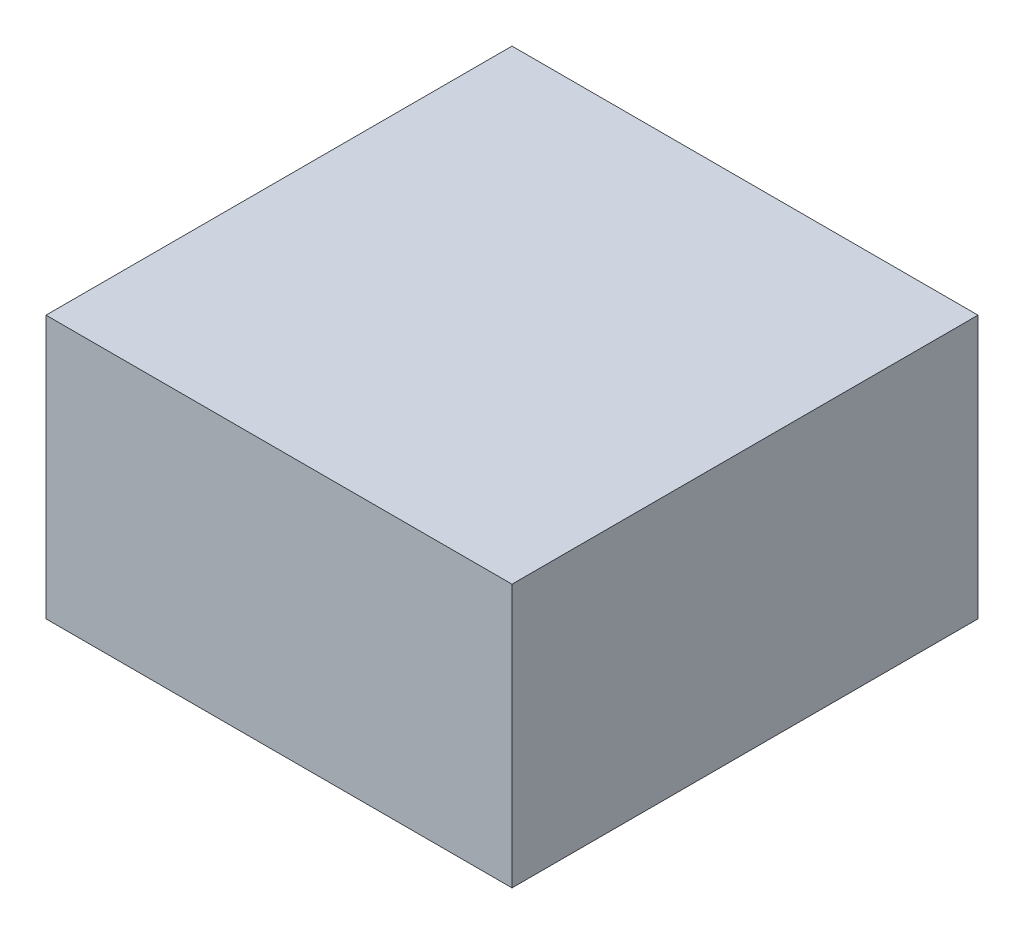
ISO-10303-21;
HEADER;
FILE_DESCRIPTION(('STEP AP214'),'2;1');
FILE_NAME('part.step','',(''),(''),'','','');
FILE_SCHEMA(('AUTOMOTIVE_DESIGN { 1 0 10303 214 1 1 1 1 }'));
ENDSEC;
DATA;
#1=APPLICATION_CONTEXT('core data for automotive mechanical design processes');
#2=APPLICATION_PROTOCOL_DEFINITION('international standard','automotive_design',2000,#1);
#3=PRODUCT_CONTEXT('',#1,'mechanical');
#4=PRODUCT('Part','Part','',(#3));
#5=PRODUCT_RELATED_PRODUCT_CATEGORY('part','',(#4));
#6=PRODUCT_DEFINITION_FORMATION('','',#4);
#7=PRODUCT_DEFINITION_CONTEXT('part definition',#1,'design');
#8=PRODUCT_DEFINITION('design','',#6,#7);
#9=PRODUCT_DEFINITION_SHAPE('','',#8);
#10=(LENGTH_UNIT() NAMED_UNIT(*) SI_UNIT(.MILLI.,.METRE.));
#11=(NAMED_UNIT(*) PLANE_ANGLE_UNIT() SI_UNIT($,.RADIAN.));
#12=(NAMED_UNIT(*) SI_UNIT($,.STERADIAN.) SOLID_ANGLE_UNIT());
#13=UNCERTAINTY_MEASURE_WITH_UNIT(LENGTH_MEASURE(1.E-05),#10,'distance_accuracy_value','');
#14=(GEOMETRIC_REPRESENTATION_CONTEXT(3) GLOBAL_UNCERTAINTY_ASSIGNED_CONTEXT((#13)) GLOBAL_UNIT_ASSIGNED_CONTEXT((#10,
#11,#12)) REPRESENTATION_CONTEXT('',''));
#15=CARTESIAN_POINT('',(0.,0.,0.));
#16=DIRECTION('',(0.,0.,1.));
#17=DIRECTION('',(1.,0.,0.));
#18=AXIS2_PLACEMENT_3D('',#15,#16,#17);
#19=CARTESIAN_POINT('',(-22.5,25.4,-22.5));
#20=DIRECTION('',(1.,0.,0.));
#21=DIRECTION('',(0.,0.,-1.));
#22=AXIS2_PLACEMENT_3D('',#19,#20,#21);
#23=PLANE('',#22);
#24=DIRECTION('',(0.,0.,1.));
#25=VECTOR('',#24,1.);
#26=CARTESIAN_POINT('',(-22.5,0.,-22.5));
#27=LINE('',#26,#25);
#28=CARTESIAN_POINT('',(-22.5,0.,-22.5));
#29=VERTEX_POINT('',#28);
#30=CARTESIAN_POINT('',(-22.5,0.,22.5));
#31=VERTEX_POINT('',#30);
#32=EDGE_CURVE('E96',#29,#31,#27,.T.);
#33=ORIENTED_EDGE('',*,*,#32,.T.);
#34=DIRECTION('',(0.,-1.,0.));
#35=VECTOR('',#34,1.);
#36=CARTESIAN_POINT('',(-22.5,25.4,22.5));
#37=LINE('',#36,#35);
#38=CARTESIAN_POINT('',(-22.5,25.4,22.5));
#39=VERTEX_POINT('',#38);
#40=EDGE_CURVE('E11',#39,#31,#37,.T.);
#41=ORIENTED_EDGE('',*,*,#40,.F.);
#42=DIRECTION('',(0.,0.,1.));
#43=VECTOR('',#42,1.);
#44=CARTESIAN_POINT('',(-22.5,25.4,-22.5));
#45=LINE('',#44,#43);
#46=CARTESIAN_POINT('',(-22.5,25.4,-22.5));
#47=VERTEX_POINT('',#46);
#48=EDGE_CURVE('E84',#47,#39,#45,.T.);
#49=ORIENTED_EDGE('',*,*,#48,.F.);
#50=DIRECTION('',(0.,-1.,0.));
#51=VECTOR('',#50,1.);
#52=CARTESIAN_POINT('',(-22.5,25.4,-22.5));
#53=LINE('',#52,#51);
#54=EDGE_CURVE('E92',#47,#29,#53,.T.);
#55=ORIENTED_EDGE('',*,*,#54,.T.);
#56=EDGE_LOOP('',(#33,#41,#49,#55));
#57=FACE_BOUND('',#56,.T.);
#58=ADVANCED_FACE('F33',(#57),#23,.F.);
#59=CARTESIAN_POINT('',(-22.5,25.4,22.5));
#60=DIRECTION('',(0.,0.,-1.));
#61=DIRECTION('',(-1.,0.,0.));
#62=AXIS2_PLACEMENT_3D('',#59,#60,#61);
#63=PLANE('',#62);
#64=DIRECTION('',(1.,0.,0.));
#65=VECTOR('',#64,1.);
#66=CARTESIAN_POINT('',(-22.5,0.,22.5));
#67=LINE('',#66,#65);
#68=CARTESIAN_POINT('',(22.5,0.,22.5));
#69=VERTEX_POINT('',#68);
#70=EDGE_CURVE('E88',#31,#69,#67,.T.);
#71=ORIENTED_EDGE('',*,*,#70,.T.);
#72=DIRECTION('',(0.,-1.,0.));
#73=VECTOR('',#72,1.);
#74=CARTESIAN_POINT('',(22.5,25.4,22.5));
#75=LINE('',#74,#73);
#76=CARTESIAN_POINT('',(22.5,25.4,22.5));
#77=VERTEX_POINT('',#76);
#78=EDGE_CURVE('E41',#77,#69,#75,.T.);
#79=ORIENTED_EDGE('',*,*,#78,.F.);
#80=DIRECTION('',(1.,0.,0.));
#81=VECTOR('',#80,1.);
#82=CARTESIAN_POINT('',(-22.5,25.4,22.5));
#83=LINE('',#82,#81);
#84=EDGE_CURVE('E79',#39,#77,#83,.T.);
#85=ORIENTED_EDGE('',*,*,#84,.F.);
#86=ORIENTED_EDGE('',*,*,#40,.T.);
#87=EDGE_LOOP('',(#71,#79,#85,#86));
#88=FACE_BOUND('',#87,.T.);
#89=ADVANCED_FACE('F87',(#88),#63,.F.);
#90=CARTESIAN_POINT('',(22.5,25.4,-22.5));
#91=DIRECTION('',(-1.,0.,0.));
#92=DIRECTION('',(0.,0.,1.));
#93=AXIS2_PLACEMENT_3D('',#90,#91,#92);
#94=PLANE('',#93);
#95=DIRECTION('',(0.,0.,-1.));
#96=VECTOR('',#95,1.);
#97=CARTESIAN_POINT('',(22.5,0.,-22.5));
#98=LINE('',#97,#96);
#99=CARTESIAN_POINT('',(22.5,0.,-22.5));
#100=VERTEX_POINT('',#99);
#101=EDGE_CURVE('E66',#69,#100,#98,.T.);
#102=ORIENTED_EDGE('',*,*,#101,.T.);
#103=DIRECTION('',(0.,-1.,0.));
#104=VECTOR('',#103,1.);
#105=CARTESIAN_POINT('',(22.5,25.4,-22.5));
#106=LINE('',#105,#104);
#107=CARTESIAN_POINT('',(22.5,25.4,-22.5));
#108=VERTEX_POINT('',#107);
#109=EDGE_CURVE('E89',#108,#100,#106,.T.);
#110=ORIENTED_EDGE('',*,*,#109,.F.);
#111=DIRECTION('',(0.,0.,-1.));
#112=VECTOR('',#111,1.);
#113=CARTESIAN_POINT('',(22.5,25.4,-22.5));
#114=LINE('',#113,#112);
#115=EDGE_CURVE('E82',#77,#108,#114,.T.);
#116=ORIENTED_EDGE('',*,*,#115,.F.);
#117=ORIENTED_EDGE('',*,*,#78,.T.);
#118=EDGE_LOOP('',(#102,#110,#116,#117));
#119=FACE_BOUND('',#118,.T.);
#120=ADVANCED_FACE('F90',(#119),#94,.F.);
#121=CARTESIAN_POINT('',(-22.5,25.4,-22.5));
#122=DIRECTION('',(0.,0.,1.));
#123=DIRECTION('',(1.,0.,0.));
#124=AXIS2_PLACEMENT_3D('',#121,#122,#123);
#125=PLANE('',#124);
#126=DIRECTION('',(-1.,0.,0.));
#127=VECTOR('',#126,1.);
#128=CARTESIAN_POINT('',(-22.5,0.,-22.5));
#129=LINE('',#128,#127);
#130=EDGE_CURVE('E72',#100,#29,#129,.T.);
#131=ORIENTED_EDGE('',*,*,#130,.T.);
#132=ORIENTED_EDGE('',*,*,#54,.F.);
#133=DIRECTION('',(-1.,0.,0.));
#134=VECTOR('',#133,1.);
#135=CARTESIAN_POINT('',(-22.5,25.4,-22.5));
#136=LINE('',#135,#134);
#137=EDGE_CURVE('E49',#108,#47,#136,.T.);
#138=ORIENTED_EDGE('',*,*,#137,.F.);
#139=ORIENTED_EDGE('',*,*,#109,.T.);
#140=EDGE_LOOP('',(#131,#132,#138,#139));
#141=FACE_BOUND('',#140,.T.);
#142=ADVANCED_FACE('F103',(#141),#125,.F.);
#143=CARTESIAN_POINT('',(0.,25.4,0.));
#144=DIRECTION('',(0.,1.,0.));
#145=DIRECTION('',(0.,0.,1.));
#146=AXIS2_PLACEMENT_3D('',#143,#144,#145);
#147=PLANE('',#146);
#148=ORIENTED_EDGE('',*,*,#48,.T.);
#149=ORIENTED_EDGE('',*,*,#84,.T.);
#150=ORIENTED_EDGE('',*,*,#115,.T.);
#151=ORIENTED_EDGE('',*,*,#137,.T.);
#152=EDGE_LOOP('',(#148,#149,#150,#151));
#153=FACE_BOUND('',#152,.T.);
#154=ADVANCED_FACE('F80',(#153),#147,.T.);
#155=CARTESIAN_POINT('',(0.,0.,0.));
#156=DIRECTION('',(0.,1.,0.));
#157=DIRECTION('',(0.,0.,1.));
#158=AXIS2_PLACEMENT_3D('',#155,#156,#157);
#159=PLANE('',#158);
#160=ORIENTED_EDGE('',*,*,#32,.F.);
#161=ORIENTED_EDGE('',*,*,#130,.F.);
#162=ORIENTED_EDGE('',*,*,#101,.F.);
#163=ORIENTED_EDGE('',*,*,#70,.F.);
#164=EDGE_LOOP('',(#160,#161,#162,#163));
#165=FACE_BOUND('',#164,.T.);
#166=ADVANCED_FACE('F106',(#165),#159,.F.);
#167=CLOSED_SHELL('',(#58,#89,#120,#142,#154,#166));
#168=MANIFOLD_SOLID_BREP('B2',#167);
#169=ADVANCED_BREP_SHAPE_REPRESENTATION('',(#18,#168),#14);
#170=SHAPE_DEFINITION_REPRESENTATION(#9,#169);
ENDSEC;
END-ISO-10303-21;
